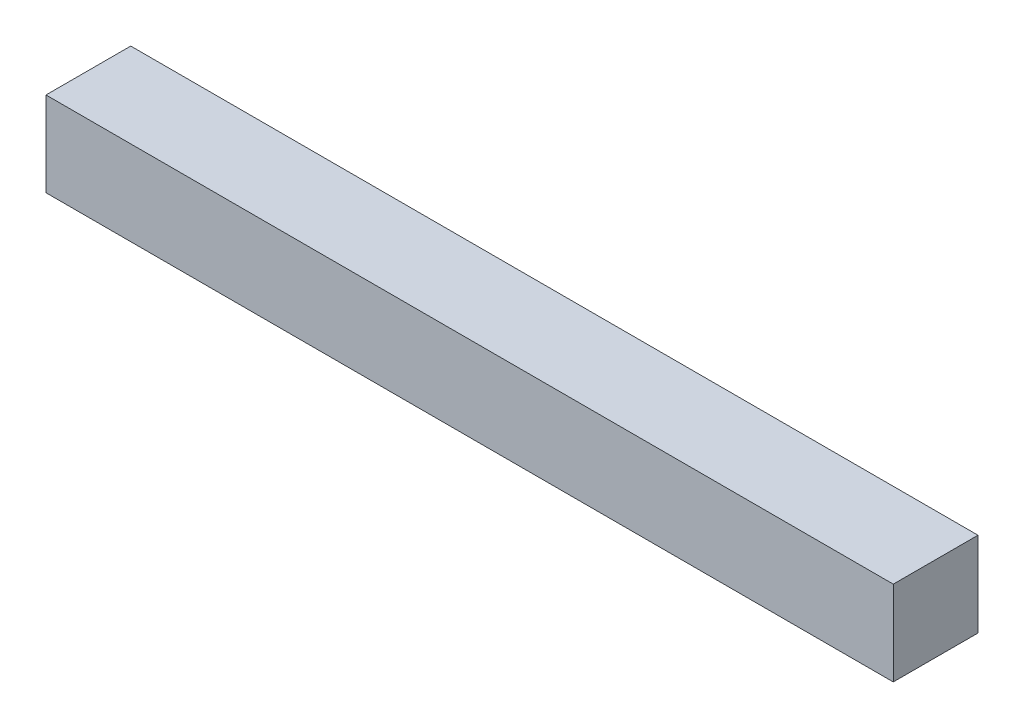
ISO-10303-21;
HEADER;
FILE_DESCRIPTION(('STEP AP214'),'2;1');
FILE_NAME('part.step','',(''),(''),'','','');
FILE_SCHEMA(('AUTOMOTIVE_DESIGN { 1 0 10303 214 1 1 1 1 }'));
ENDSEC;
DATA;
#1=APPLICATION_CONTEXT('core data for automotive mechanical design processes');
#2=APPLICATION_PROTOCOL_DEFINITION('international standard','automotive_design',2000,#1);
#3=PRODUCT_CONTEXT('',#1,'mechanical');
#4=PRODUCT('Part','Part','',(#3));
#5=PRODUCT_RELATED_PRODUCT_CATEGORY('part','',(#4));
#6=PRODUCT_DEFINITION_FORMATION('','',#4);
#7=PRODUCT_DEFINITION_CONTEXT('part definition',#1,'design');
#8=PRODUCT_DEFINITION('design','',#6,#7);
#9=PRODUCT_DEFINITION_SHAPE('','',#8);
#10=(LENGTH_UNIT() NAMED_UNIT(*) SI_UNIT(.MILLI.,.METRE.));
#11=(NAMED_UNIT(*) PLANE_ANGLE_UNIT() SI_UNIT($,.RADIAN.));
#12=(NAMED_UNIT(*) SI_UNIT($,.STERADIAN.) SOLID_ANGLE_UNIT());
#13=UNCERTAINTY_MEASURE_WITH_UNIT(LENGTH_MEASURE(1.E-05),#10,'distance_accuracy_value','');
#14=(GEOMETRIC_REPRESENTATION_CONTEXT(3) GLOBAL_UNCERTAINTY_ASSIGNED_CONTEXT((#13)) GLOBAL_UNIT_ASSIGNED_CONTEXT((#10,
#11,#12)) REPRESENTATION_CONTEXT('',''));
#15=CARTESIAN_POINT('',(0.,0.,0.));
#16=DIRECTION('',(0.,0.,1.));
#17=DIRECTION('',(1.,0.,0.));
#18=AXIS2_PLACEMENT_3D('',#15,#16,#17);
#19=CARTESIAN_POINT('',(-68.6267419763514,15.3515625,30.));
#20=DIRECTION('',(1.,0.,0.));
#21=DIRECTION('',(0.,0.,-1.));
#22=AXIS2_PLACEMENT_3D('',#19,#20,#21);
#23=PLANE('',#22);
#24=DIRECTION('',(0.,-1.,0.));
#25=VECTOR('',#24,1.);
#26=CARTESIAN_POINT('',(-68.6267419763514,15.3515625,0.));
#27=LINE('',#26,#25);
#28=CARTESIAN_POINT('',(-68.6267419763514,15.3515625,0.));
#29=VERTEX_POINT('',#28);
#30=CARTESIAN_POINT('',(-68.6267419763514,-14.6484375,0.));
#31=VERTEX_POINT('',#30);
#32=EDGE_CURVE('E98',#29,#31,#27,.T.);
#33=ORIENTED_EDGE('',*,*,#32,.T.);
#34=DIRECTION('',(0.,0.,-1.));
#35=VECTOR('',#34,1.);
#36=CARTESIAN_POINT('',(-68.6267419763514,-14.6484375,30.));
#37=LINE('',#36,#35);
#38=CARTESIAN_POINT('',(-68.6267419763514,-14.6484375,30.));
#39=VERTEX_POINT('',#38);
#40=EDGE_CURVE('E11',#39,#31,#37,.T.);
#41=ORIENTED_EDGE('',*,*,#40,.F.);
#42=DIRECTION('',(0.,-1.,0.));
#43=VECTOR('',#42,1.);
#44=CARTESIAN_POINT('',(-68.6267419763514,15.3515625,30.));
#45=LINE('',#44,#43);
#46=CARTESIAN_POINT('',(-68.6267419763514,15.3515625,30.));
#47=VERTEX_POINT('',#46);
#48=EDGE_CURVE('E86',#47,#39,#45,.T.);
#49=ORIENTED_EDGE('',*,*,#48,.F.);
#50=DIRECTION('',(0.,0.,-1.));
#51=VECTOR('',#50,1.);
#52=CARTESIAN_POINT('',(-68.6267419763514,15.3515625,30.));
#53=LINE('',#52,#51);
#54=EDGE_CURVE('E94',#47,#29,#53,.T.);
#55=ORIENTED_EDGE('',*,*,#54,.T.);
#56=EDGE_LOOP('',(#33,#41,#49,#55));
#57=FACE_BOUND('',#56,.T.);
#58=ADVANCED_FACE('F35',(#57),#23,.F.);
#59=CARTESIAN_POINT('',(-68.6267419763514,-14.6484375,30.));
#60=DIRECTION('',(0.,1.,0.));
#61=DIRECTION('',(-1.,0.,0.));
#62=AXIS2_PLACEMENT_3D('',#59,#60,#61);
#63=PLANE('',#62);
#64=DIRECTION('',(1.,0.,0.));
#65=VECTOR('',#64,1.);
#66=CARTESIAN_POINT('',(-68.6267419763514,-14.6484375,0.));
#67=LINE('',#66,#65);
#68=CARTESIAN_POINT('',(231.373258023649,-14.6484375,0.));
#69=VERTEX_POINT('',#68);
#70=EDGE_CURVE('E90',#31,#69,#67,.T.);
#71=ORIENTED_EDGE('',*,*,#70,.T.);
#72=DIRECTION('',(0.,0.,-1.));
#73=VECTOR('',#72,1.);
#74=CARTESIAN_POINT('',(231.373258023649,-14.6484375,30.));
#75=LINE('',#74,#73);
#76=CARTESIAN_POINT('',(231.373258023649,-14.6484375,30.));
#77=VERTEX_POINT('',#76);
#78=EDGE_CURVE('E43',#77,#69,#75,.T.);
#79=ORIENTED_EDGE('',*,*,#78,.F.);
#80=DIRECTION('',(1.,0.,0.));
#81=VECTOR('',#80,1.);
#82=CARTESIAN_POINT('',(-68.6267419763514,-14.6484375,30.));
#83=LINE('',#82,#81);
#84=EDGE_CURVE('E81',#39,#77,#83,.T.);
#85=ORIENTED_EDGE('',*,*,#84,.F.);
#86=ORIENTED_EDGE('',*,*,#40,.T.);
#87=EDGE_LOOP('',(#71,#79,#85,#86));
#88=FACE_BOUND('',#87,.T.);
#89=ADVANCED_FACE('F89',(#88),#63,.F.);
#90=CARTESIAN_POINT('',(231.373258023649,15.3515625,30.));
#91=DIRECTION('',(-1.,0.,0.));
#92=DIRECTION('',(0.,0.,1.));
#93=AXIS2_PLACEMENT_3D('',#90,#91,#92);
#94=PLANE('',#93);
#95=DIRECTION('',(0.,1.,0.));
#96=VECTOR('',#95,1.);
#97=CARTESIAN_POINT('',(231.373258023649,15.3515625,0.));
#98=LINE('',#97,#96);
#99=CARTESIAN_POINT('',(231.373258023649,15.3515625,0.));
#100=VERTEX_POINT('',#99);
#101=EDGE_CURVE('E68',#69,#100,#98,.T.);
#102=ORIENTED_EDGE('',*,*,#101,.T.);
#103=DIRECTION('',(0.,0.,-1.));
#104=VECTOR('',#103,1.);
#105=CARTESIAN_POINT('',(231.373258023649,15.3515625,30.));
#106=LINE('',#105,#104);
#107=CARTESIAN_POINT('',(231.373258023649,15.3515625,30.));
#108=VERTEX_POINT('',#107);
#109=EDGE_CURVE('E91',#108,#100,#106,.T.);
#110=ORIENTED_EDGE('',*,*,#109,.F.);
#111=DIRECTION('',(0.,1.,0.));
#112=VECTOR('',#111,1.);
#113=CARTESIAN_POINT('',(231.373258023649,15.3515625,30.));
#114=LINE('',#113,#112);
#115=EDGE_CURVE('E84',#77,#108,#114,.T.);
#116=ORIENTED_EDGE('',*,*,#115,.F.);
#117=ORIENTED_EDGE('',*,*,#78,.T.);
#118=EDGE_LOOP('',(#102,#110,#116,#117));
#119=FACE_BOUND('',#118,.T.);
#120=ADVANCED_FACE('F92',(#119),#94,.F.);
#121=CARTESIAN_POINT('',(-68.6267419763514,15.3515625,30.));
#122=DIRECTION('',(0.,-1.,0.));
#123=DIRECTION('',(0.,0.,-1.));
#124=AXIS2_PLACEMENT_3D('',#121,#122,#123);
#125=PLANE('',#124);
#126=DIRECTION('',(-1.,0.,0.));
#127=VECTOR('',#126,1.);
#128=CARTESIAN_POINT('',(-68.6267419763514,15.3515625,0.));
#129=LINE('',#128,#127);
#130=EDGE_CURVE('E74',#100,#29,#129,.T.);
#131=ORIENTED_EDGE('',*,*,#130,.T.);
#132=ORIENTED_EDGE('',*,*,#54,.F.);
#133=DIRECTION('',(-1.,0.,0.));
#134=VECTOR('',#133,1.);
#135=CARTESIAN_POINT('',(-68.6267419763514,15.3515625,30.));
#136=LINE('',#135,#134);
#137=EDGE_CURVE('E51',#108,#47,#136,.T.);
#138=ORIENTED_EDGE('',*,*,#137,.F.);
#139=ORIENTED_EDGE('',*,*,#109,.T.);
#140=EDGE_LOOP('',(#131,#132,#138,#139));
#141=FACE_BOUND('',#140,.T.);
#142=ADVANCED_FACE('F106',(#141),#125,.F.);
#143=CARTESIAN_POINT('',(0.,0.,30.));
#144=DIRECTION('',(0.,0.,1.));
#145=DIRECTION('',(1.,0.,0.));
#146=AXIS2_PLACEMENT_3D('',#143,#144,#145);
#147=PLANE('',#146);
#148=ORIENTED_EDGE('',*,*,#48,.T.);
#149=ORIENTED_EDGE('',*,*,#84,.T.);
#150=ORIENTED_EDGE('',*,*,#115,.T.);
#151=ORIENTED_EDGE('',*,*,#137,.T.);
#152=EDGE_LOOP('',(#148,#149,#150,#151));
#153=FACE_BOUND('',#152,.T.);
#154=ADVANCED_FACE('F82',(#153),#147,.T.);
#155=CARTESIAN_POINT('',(0.,0.,0.));
#156=DIRECTION('',(0.,0.,1.));
#157=DIRECTION('',(1.,0.,0.));
#158=AXIS2_PLACEMENT_3D('',#155,#156,#157);
#159=PLANE('',#158);
#160=CARTESIAN_POINT('',(-53.6267419763514,0.351562499999998,0.));
#161=DIRECTION('',(0.,0.,1.));
#162=DIRECTION('',(1.,0.,0.));
#163=AXIS2_PLACEMENT_3D('',#160,#161,#162);
#164=CIRCLE('',#163,5.99999999999999);
#165=CARTESIAN_POINT('',(-47.6267419763514,0.351562499999998,0.));
#166=VERTEX_POINT('',#165);
#167=EDGE_CURVE('E166',#166,#166,#164,.T.);
#168=ORIENTED_EDGE('',*,*,#167,.T.);
#169=EDGE_LOOP('',(#168));
#170=FACE_BOUND('',#169,.T.);
#171=CARTESIAN_POINT('',(-23.6267419763514,0.351562499999998,0.));
#172=DIRECTION('',(0.,0.,1.));
#173=DIRECTION('',(1.,0.,0.));
#174=AXIS2_PLACEMENT_3D('',#171,#172,#173);
#175=CIRCLE('',#174,6.);
#176=CARTESIAN_POINT('',(-17.6267419763514,0.351562499999998,0.));
#177=VERTEX_POINT('',#176);
#178=EDGE_CURVE('E160',#177,#177,#175,.T.);
#179=ORIENTED_EDGE('',*,*,#178,.T.);
#180=EDGE_LOOP('',(#179));
#181=FACE_BOUND('',#180,.T.);
#182=CARTESIAN_POINT('',(6.37325802364862,0.351562499999998,0.));
#183=DIRECTION('',(0.,0.,1.));
#184=DIRECTION('',(1.,0.,0.));
#185=AXIS2_PLACEMENT_3D('',#182,#183,#184);
#186=CIRCLE('',#185,6.);
#187=CARTESIAN_POINT('',(12.3732580236486,0.351562499999998,0.));
#188=VERTEX_POINT('',#187);
#189=EDGE_CURVE('E154',#188,#188,#186,.T.);
#190=ORIENTED_EDGE('',*,*,#189,.T.);
#191=EDGE_LOOP('',(#190));
#192=FACE_BOUND('',#191,.T.);
#193=CARTESIAN_POINT('',(36.3732580236486,0.351562499999998,0.));
#194=DIRECTION('',(0.,0.,1.));
#195=DIRECTION('',(1.,0.,0.));
#196=AXIS2_PLACEMENT_3D('',#193,#194,#195);
#197=CIRCLE('',#196,5.99999999999999);
#198=CARTESIAN_POINT('',(42.3732580236486,0.351562499999998,0.));
#199=VERTEX_POINT('',#198);
#200=EDGE_CURVE('E148',#199,#199,#197,.T.);
#201=ORIENTED_EDGE('',*,*,#200,.T.);
#202=EDGE_LOOP('',(#201));
#203=FACE_BOUND('',#202,.T.);
#204=CARTESIAN_POINT('',(66.3732580236486,0.351562499999998,0.));
#205=DIRECTION('',(0.,0.,1.));
#206=DIRECTION('',(1.,0.,0.));
#207=AXIS2_PLACEMENT_3D('',#204,#205,#206);
#208=CIRCLE('',#207,6.);
#209=CARTESIAN_POINT('',(72.3732580236486,0.351562499999998,0.));
#210=VERTEX_POINT('',#209);
#211=EDGE_CURVE('E142',#210,#210,#208,.T.);
#212=ORIENTED_EDGE('',*,*,#211,.T.);
#213=EDGE_LOOP('',(#212));
#214=FACE_BOUND('',#213,.T.);
#215=CARTESIAN_POINT('',(96.3732580236486,0.351562499999998,0.));
#216=DIRECTION('',(0.,0.,1.));
#217=DIRECTION('',(1.,0.,0.));
#218=AXIS2_PLACEMENT_3D('',#215,#216,#217);
#219=CIRCLE('',#218,6.);
#220=CARTESIAN_POINT('',(102.373258023649,0.351562499999998,0.));
#221=VERTEX_POINT('',#220);
#222=EDGE_CURVE('E136',#221,#221,#219,.T.);
#223=ORIENTED_EDGE('',*,*,#222,.T.);
#224=EDGE_LOOP('',(#223));
#225=FACE_BOUND('',#224,.T.);
#226=CARTESIAN_POINT('',(126.373258023649,0.351562499999998,0.));
#227=DIRECTION('',(0.,0.,1.));
#228=DIRECTION('',(1.,0.,0.));
#229=AXIS2_PLACEMENT_3D('',#226,#227,#228);
#230=CIRCLE('',#229,6.00000000000002);
#231=CARTESIAN_POINT('',(132.373258023649,0.351562499999998,0.));
#232=VERTEX_POINT('',#231);
#233=EDGE_CURVE('E130',#232,#232,#230,.T.);
#234=ORIENTED_EDGE('',*,*,#233,.T.);
#235=EDGE_LOOP('',(#234));
#236=FACE_BOUND('',#235,.T.);
#237=CARTESIAN_POINT('',(156.373258023649,0.351562499999998,0.));
#238=DIRECTION('',(0.,0.,1.));
#239=DIRECTION('',(1.,0.,0.));
#240=AXIS2_PLACEMENT_3D('',#237,#238,#239);
#241=CIRCLE('',#240,6.00000000000002);
#242=CARTESIAN_POINT('',(162.373258023649,0.351562499999998,0.));
#243=VERTEX_POINT('',#242);
#244=EDGE_CURVE('E124',#243,#243,#241,.T.);
#245=ORIENTED_EDGE('',*,*,#244,.T.);
#246=EDGE_LOOP('',(#245));
#247=FACE_BOUND('',#246,.T.);
#248=CARTESIAN_POINT('',(186.373258023649,0.351562499999998,0.));
#249=DIRECTION('',(0.,0.,1.));
#250=DIRECTION('',(1.,0.,0.));
#251=AXIS2_PLACEMENT_3D('',#248,#249,#250);
#252=CIRCLE('',#251,6.00000000000002);
#253=CARTESIAN_POINT('',(192.373258023649,0.351562499999998,0.));
#254=VERTEX_POINT('',#253);
#255=EDGE_CURVE('E118',#254,#254,#252,.T.);
#256=ORIENTED_EDGE('',*,*,#255,.T.);
#257=EDGE_LOOP('',(#256));
#258=FACE_BOUND('',#257,.T.);
#259=CARTESIAN_POINT('',(216.373258023649,0.351562499999998,0.));
#260=DIRECTION('',(0.,0.,1.));
#261=DIRECTION('',(1.,0.,0.));
#262=AXIS2_PLACEMENT_3D('',#259,#260,#261);
#263=CIRCLE('',#262,6.00000000000002);
#264=CARTESIAN_POINT('',(222.373258023649,0.351562499999998,0.));
#265=VERTEX_POINT('',#264);
#266=EDGE_CURVE('E112',#265,#265,#263,.T.);
#267=ORIENTED_EDGE('',*,*,#266,.T.);
#268=EDGE_LOOP('',(#267));
#269=FACE_BOUND('',#268,.T.);
#270=ORIENTED_EDGE('',*,*,#32,.F.);
#271=ORIENTED_EDGE('',*,*,#130,.F.);
#272=ORIENTED_EDGE('',*,*,#101,.F.);
#273=ORIENTED_EDGE('',*,*,#70,.F.);
#274=EDGE_LOOP('',(#270,#271,#272,#273));
#275=FACE_BOUND('',#274,.T.);
#276=ADVANCED_FACE('F109',(#170,#181,#192,#203,#214,#225,#236,#247,#258,#269,#275),#159,.F.);
#277=CARTESIAN_POINT('',(216.373258023649,0.351562499999998,10.));
#278=DIRECTION('',(0.,0.,-1.));
#279=DIRECTION('',(-1.,0.,0.));
#280=AXIS2_PLACEMENT_3D('',#277,#278,#279);
#281=CYLINDRICAL_SURFACE('',#280,6.00000000000002);
#282=CARTESIAN_POINT('',(216.373258023649,0.351562499999998,10.));
#283=DIRECTION('',(0.,0.,1.));
#284=DIRECTION('',(1.,0.,0.));
#285=AXIS2_PLACEMENT_3D('',#282,#283,#284);
#286=CIRCLE('',#285,6.00000000000002);
#287=CARTESIAN_POINT('',(222.373258023649,0.351562499999998,10.));
#288=VERTEX_POINT('',#287);
#289=EDGE_CURVE('E115',#288,#288,#286,.T.);
#290=ORIENTED_EDGE('',*,*,#289,.T.);
#291=EDGE_LOOP('',(#290));
#292=FACE_BOUND('',#291,.T.);
#293=ORIENTED_EDGE('',*,*,#266,.F.);
#294=EDGE_LOOP('',(#293));
#295=FACE_BOUND('',#294,.T.);
#296=ADVANCED_FACE('F196',(#292,#295),#281,.F.);
#297=CARTESIAN_POINT('',(216.373258023649,0.351562499999998,10.));
#298=DIRECTION('',(0.,0.,1.));
#299=DIRECTION('',(1.,0.,0.));
#300=AXIS2_PLACEMENT_3D('',#297,#298,#299);
#301=PLANE('',#300);
#302=ORIENTED_EDGE('',*,*,#289,.F.);
#303=EDGE_LOOP('',(#302));
#304=FACE_BOUND('',#303,.T.);
#305=ADVANCED_FACE('F202',(#304),#301,.F.);
#306=CARTESIAN_POINT('',(186.373258023649,0.351562499999998,10.));
#307=DIRECTION('',(0.,0.,-1.));
#308=DIRECTION('',(-1.,0.,0.));
#309=AXIS2_PLACEMENT_3D('',#306,#307,#308);
#310=CYLINDRICAL_SURFACE('',#309,6.00000000000002);
#311=CARTESIAN_POINT('',(186.373258023649,0.351562499999998,10.));
#312=DIRECTION('',(0.,0.,1.));
#313=DIRECTION('',(1.,0.,0.));
#314=AXIS2_PLACEMENT_3D('',#311,#312,#313);
#315=CIRCLE('',#314,6.00000000000002);
#316=CARTESIAN_POINT('',(192.373258023649,0.351562499999998,10.));
#317=VERTEX_POINT('',#316);
#318=EDGE_CURVE('E121',#317,#317,#315,.T.);
#319=ORIENTED_EDGE('',*,*,#318,.T.);
#320=EDGE_LOOP('',(#319));
#321=FACE_BOUND('',#320,.T.);
#322=ORIENTED_EDGE('',*,*,#255,.F.);
#323=EDGE_LOOP('',(#322));
#324=FACE_BOUND('',#323,.T.);
#325=ADVANCED_FACE('F206',(#321,#324),#310,.F.);
#326=CARTESIAN_POINT('',(186.373258023649,0.351562499999998,10.));
#327=DIRECTION('',(0.,0.,1.));
#328=DIRECTION('',(1.,0.,0.));
#329=AXIS2_PLACEMENT_3D('',#326,#327,#328);
#330=PLANE('',#329);
#331=ORIENTED_EDGE('',*,*,#318,.F.);
#332=EDGE_LOOP('',(#331));
#333=FACE_BOUND('',#332,.T.);
#334=ADVANCED_FACE('F210',(#333),#330,.F.);
#335=CARTESIAN_POINT('',(156.373258023649,0.351562499999998,10.));
#336=DIRECTION('',(0.,0.,-1.));
#337=DIRECTION('',(-1.,0.,0.));
#338=AXIS2_PLACEMENT_3D('',#335,#336,#337);
#339=CYLINDRICAL_SURFACE('',#338,6.00000000000002);
#340=CARTESIAN_POINT('',(156.373258023649,0.351562499999998,10.));
#341=DIRECTION('',(0.,0.,1.));
#342=DIRECTION('',(1.,0.,0.));
#343=AXIS2_PLACEMENT_3D('',#340,#341,#342);
#344=CIRCLE('',#343,6.00000000000002);
#345=CARTESIAN_POINT('',(162.373258023649,0.351562499999998,10.));
#346=VERTEX_POINT('',#345);
#347=EDGE_CURVE('E127',#346,#346,#344,.T.);
#348=ORIENTED_EDGE('',*,*,#347,.T.);
#349=EDGE_LOOP('',(#348));
#350=FACE_BOUND('',#349,.T.);
#351=ORIENTED_EDGE('',*,*,#244,.F.);
#352=EDGE_LOOP('',(#351));
#353=FACE_BOUND('',#352,.T.);
#354=ADVANCED_FACE('F214',(#350,#353),#339,.F.);
#355=CARTESIAN_POINT('',(156.373258023649,0.351562499999998,10.));
#356=DIRECTION('',(0.,0.,1.));
#357=DIRECTION('',(1.,0.,0.));
#358=AXIS2_PLACEMENT_3D('',#355,#356,#357);
#359=PLANE('',#358);
#360=ORIENTED_EDGE('',*,*,#347,.F.);
#361=EDGE_LOOP('',(#360));
#362=FACE_BOUND('',#361,.T.);
#363=ADVANCED_FACE('F218',(#362),#359,.F.);
#364=CARTESIAN_POINT('',(126.373258023649,0.351562499999998,10.));
#365=DIRECTION('',(0.,0.,-1.));
#366=DIRECTION('',(-1.,0.,0.));
#367=AXIS2_PLACEMENT_3D('',#364,#365,#366);
#368=CYLINDRICAL_SURFACE('',#367,6.00000000000002);
#369=CARTESIAN_POINT('',(126.373258023649,0.351562499999998,10.));
#370=DIRECTION('',(0.,0.,1.));
#371=DIRECTION('',(1.,0.,0.));
#372=AXIS2_PLACEMENT_3D('',#369,#370,#371);
#373=CIRCLE('',#372,6.00000000000002);
#374=CARTESIAN_POINT('',(132.373258023649,0.351562499999998,10.));
#375=VERTEX_POINT('',#374);
#376=EDGE_CURVE('E133',#375,#375,#373,.T.);
#377=ORIENTED_EDGE('',*,*,#376,.T.);
#378=EDGE_LOOP('',(#377));
#379=FACE_BOUND('',#378,.T.);
#380=ORIENTED_EDGE('',*,*,#233,.F.);
#381=EDGE_LOOP('',(#380));
#382=FACE_BOUND('',#381,.T.);
#383=ADVANCED_FACE('F222',(#379,#382),#368,.F.);
#384=CARTESIAN_POINT('',(126.373258023649,0.351562499999998,10.));
#385=DIRECTION('',(0.,0.,1.));
#386=DIRECTION('',(1.,0.,0.));
#387=AXIS2_PLACEMENT_3D('',#384,#385,#386);
#388=PLANE('',#387);
#389=ORIENTED_EDGE('',*,*,#376,.F.);
#390=EDGE_LOOP('',(#389));
#391=FACE_BOUND('',#390,.T.);
#392=ADVANCED_FACE('F226',(#391),#388,.F.);
#393=CARTESIAN_POINT('',(96.3732580236486,0.351562499999998,10.));
#394=DIRECTION('',(0.,0.,-1.));
#395=DIRECTION('',(-1.,0.,0.));
#396=AXIS2_PLACEMENT_3D('',#393,#394,#395);
#397=CYLINDRICAL_SURFACE('',#396,6.);
#398=CARTESIAN_POINT('',(96.3732580236486,0.351562499999998,10.));
#399=DIRECTION('',(0.,0.,1.));
#400=DIRECTION('',(1.,0.,0.));
#401=AXIS2_PLACEMENT_3D('',#398,#399,#400);
#402=CIRCLE('',#401,6.);
#403=CARTESIAN_POINT('',(102.373258023649,0.351562499999998,10.));
#404=VERTEX_POINT('',#403);
#405=EDGE_CURVE('E139',#404,#404,#402,.T.);
#406=ORIENTED_EDGE('',*,*,#405,.T.);
#407=EDGE_LOOP('',(#406));
#408=FACE_BOUND('',#407,.T.);
#409=ORIENTED_EDGE('',*,*,#222,.F.);
#410=EDGE_LOOP('',(#409));
#411=FACE_BOUND('',#410,.T.);
#412=ADVANCED_FACE('F230',(#408,#411),#397,.F.);
#413=CARTESIAN_POINT('',(96.3732580236486,0.351562499999998,10.));
#414=DIRECTION('',(0.,0.,1.));
#415=DIRECTION('',(1.,0.,0.));
#416=AXIS2_PLACEMENT_3D('',#413,#414,#415);
#417=PLANE('',#416);
#418=ORIENTED_EDGE('',*,*,#405,.F.);
#419=EDGE_LOOP('',(#418));
#420=FACE_BOUND('',#419,.T.);
#421=ADVANCED_FACE('F234',(#420),#417,.F.);
#422=CARTESIAN_POINT('',(66.3732580236486,0.351562499999998,10.));
#423=DIRECTION('',(0.,0.,-1.));
#424=DIRECTION('',(-1.,0.,0.));
#425=AXIS2_PLACEMENT_3D('',#422,#423,#424);
#426=CYLINDRICAL_SURFACE('',#425,6.);
#427=CARTESIAN_POINT('',(66.3732580236486,0.351562499999998,10.));
#428=DIRECTION('',(0.,0.,1.));
#429=DIRECTION('',(1.,0.,0.));
#430=AXIS2_PLACEMENT_3D('',#427,#428,#429);
#431=CIRCLE('',#430,6.);
#432=CARTESIAN_POINT('',(72.3732580236486,0.351562499999998,10.));
#433=VERTEX_POINT('',#432);
#434=EDGE_CURVE('E145',#433,#433,#431,.T.);
#435=ORIENTED_EDGE('',*,*,#434,.T.);
#436=EDGE_LOOP('',(#435));
#437=FACE_BOUND('',#436,.T.);
#438=ORIENTED_EDGE('',*,*,#211,.F.);
#439=EDGE_LOOP('',(#438));
#440=FACE_BOUND('',#439,.T.);
#441=ADVANCED_FACE('F238',(#437,#440),#426,.F.);
#442=CARTESIAN_POINT('',(66.3732580236486,0.351562499999998,10.));
#443=DIRECTION('',(0.,0.,1.));
#444=DIRECTION('',(1.,0.,0.));
#445=AXIS2_PLACEMENT_3D('',#442,#443,#444);
#446=PLANE('',#445);
#447=ORIENTED_EDGE('',*,*,#434,.F.);
#448=EDGE_LOOP('',(#447));
#449=FACE_BOUND('',#448,.T.);
#450=ADVANCED_FACE('F242',(#449),#446,.F.);
#451=CARTESIAN_POINT('',(36.3732580236486,0.351562499999998,10.));
#452=DIRECTION('',(0.,0.,-1.));
#453=DIRECTION('',(-1.,0.,0.));
#454=AXIS2_PLACEMENT_3D('',#451,#452,#453);
#455=CYLINDRICAL_SURFACE('',#454,5.99999999999999);
#456=CARTESIAN_POINT('',(36.3732580236486,0.351562499999998,10.));
#457=DIRECTION('',(0.,0.,1.));
#458=DIRECTION('',(1.,0.,0.));
#459=AXIS2_PLACEMENT_3D('',#456,#457,#458);
#460=CIRCLE('',#459,5.99999999999999);
#461=CARTESIAN_POINT('',(42.3732580236486,0.351562499999998,10.));
#462=VERTEX_POINT('',#461);
#463=EDGE_CURVE('E151',#462,#462,#460,.T.);
#464=ORIENTED_EDGE('',*,*,#463,.T.);
#465=EDGE_LOOP('',(#464));
#466=FACE_BOUND('',#465,.T.);
#467=ORIENTED_EDGE('',*,*,#200,.F.);
#468=EDGE_LOOP('',(#467));
#469=FACE_BOUND('',#468,.T.);
#470=ADVANCED_FACE('F246',(#466,#469),#455,.F.);
#471=CARTESIAN_POINT('',(36.3732580236486,0.351562499999998,10.));
#472=DIRECTION('',(0.,0.,1.));
#473=DIRECTION('',(1.,0.,0.));
#474=AXIS2_PLACEMENT_3D('',#471,#472,#473);
#475=PLANE('',#474);
#476=ORIENTED_EDGE('',*,*,#463,.F.);
#477=EDGE_LOOP('',(#476));
#478=FACE_BOUND('',#477,.T.);
#479=ADVANCED_FACE('F250',(#478),#475,.F.);
#480=CARTESIAN_POINT('',(6.37325802364862,0.351562499999998,10.));
#481=DIRECTION('',(0.,0.,-1.));
#482=DIRECTION('',(-1.,0.,0.));
#483=AXIS2_PLACEMENT_3D('',#480,#481,#482);
#484=CYLINDRICAL_SURFACE('',#483,6.);
#485=CARTESIAN_POINT('',(6.37325802364862,0.351562499999998,10.));
#486=DIRECTION('',(0.,0.,1.));
#487=DIRECTION('',(1.,0.,0.));
#488=AXIS2_PLACEMENT_3D('',#485,#486,#487);
#489=CIRCLE('',#488,6.);
#490=CARTESIAN_POINT('',(12.3732580236486,0.351562499999998,10.));
#491=VERTEX_POINT('',#490);
#492=EDGE_CURVE('E157',#491,#491,#489,.T.);
#493=ORIENTED_EDGE('',*,*,#492,.T.);
#494=EDGE_LOOP('',(#493));
#495=FACE_BOUND('',#494,.T.);
#496=ORIENTED_EDGE('',*,*,#189,.F.);
#497=EDGE_LOOP('',(#496));
#498=FACE_BOUND('',#497,.T.);
#499=ADVANCED_FACE('F254',(#495,#498),#484,.F.);
#500=CARTESIAN_POINT('',(6.37325802364862,0.351562499999998,10.));
#501=DIRECTION('',(0.,0.,1.));
#502=DIRECTION('',(1.,0.,0.));
#503=AXIS2_PLACEMENT_3D('',#500,#501,#502);
#504=PLANE('',#503);
#505=ORIENTED_EDGE('',*,*,#492,.F.);
#506=EDGE_LOOP('',(#505));
#507=FACE_BOUND('',#506,.T.);
#508=ADVANCED_FACE('F258',(#507),#504,.F.);
#509=CARTESIAN_POINT('',(-23.6267419763514,0.351562499999998,10.));
#510=DIRECTION('',(0.,0.,-1.));
#511=DIRECTION('',(-1.,0.,0.));
#512=AXIS2_PLACEMENT_3D('',#509,#510,#511);
#513=CYLINDRICAL_SURFACE('',#512,6.);
#514=CARTESIAN_POINT('',(-23.6267419763514,0.351562499999998,10.));
#515=DIRECTION('',(0.,0.,1.));
#516=DIRECTION('',(1.,0.,0.));
#517=AXIS2_PLACEMENT_3D('',#514,#515,#516);
#518=CIRCLE('',#517,6.);
#519=CARTESIAN_POINT('',(-17.6267419763514,0.351562499999998,10.));
#520=VERTEX_POINT('',#519);
#521=EDGE_CURVE('E163',#520,#520,#518,.T.);
#522=ORIENTED_EDGE('',*,*,#521,.T.);
#523=EDGE_LOOP('',(#522));
#524=FACE_BOUND('',#523,.T.);
#525=ORIENTED_EDGE('',*,*,#178,.F.);
#526=EDGE_LOOP('',(#525));
#527=FACE_BOUND('',#526,.T.);
#528=ADVANCED_FACE('F262',(#524,#527),#513,.F.);
#529=CARTESIAN_POINT('',(-23.6267419763514,0.351562499999998,10.));
#530=DIRECTION('',(0.,0.,1.));
#531=DIRECTION('',(1.,0.,0.));
#532=AXIS2_PLACEMENT_3D('',#529,#530,#531);
#533=PLANE('',#532);
#534=ORIENTED_EDGE('',*,*,#521,.F.);
#535=EDGE_LOOP('',(#534));
#536=FACE_BOUND('',#535,.T.);
#537=ADVANCED_FACE('F181',(#536),#533,.F.);
#538=CARTESIAN_POINT('',(-53.6267419763514,0.351562499999998,10.));
#539=DIRECTION('',(0.,0.,-1.));
#540=DIRECTION('',(-1.,0.,0.));
#541=AXIS2_PLACEMENT_3D('',#538,#539,#540);
#542=CYLINDRICAL_SURFACE('',#541,5.99999999999999);
#543=CARTESIAN_POINT('',(-53.6267419763514,0.351562499999998,10.));
#544=DIRECTION('',(0.,0.,1.));
#545=DIRECTION('',(1.,0.,0.));
#546=AXIS2_PLACEMENT_3D('',#543,#544,#545);
#547=CIRCLE('',#546,5.99999999999999);
#548=CARTESIAN_POINT('',(-47.6267419763514,0.351562499999998,10.));
#549=VERTEX_POINT('',#548);
#550=EDGE_CURVE('E101',#549,#549,#547,.T.);
#551=ORIENTED_EDGE('',*,*,#550,.T.);
#552=EDGE_LOOP('',(#551));
#553=FACE_BOUND('',#552,.T.);
#554=ORIENTED_EDGE('',*,*,#167,.F.);
#555=EDGE_LOOP('',(#554));
#556=FACE_BOUND('',#555,.T.);
#557=ADVANCED_FACE('F172',(#553,#556),#542,.F.);
#558=CARTESIAN_POINT('',(-53.6267419763514,0.351562499999998,10.));
#559=DIRECTION('',(0.,0.,1.));
#560=DIRECTION('',(1.,0.,0.));
#561=AXIS2_PLACEMENT_3D('',#558,#559,#560);
#562=PLANE('',#561);
#563=ORIENTED_EDGE('',*,*,#550,.F.);
#564=EDGE_LOOP('',(#563));
#565=FACE_BOUND('',#564,.T.);
#566=ADVANCED_FACE('F175',(#565),#562,.F.);
#567=CLOSED_SHELL('',(#58,#89,#120,#142,#154,#276,#296,#305,#325,#334,#354,#363,#383,#392,#412,
#421,#441,#450,#470,#479,#499,#508,#528,#537,#557,#566));
#568=MANIFOLD_SOLID_BREP('B2',#567);
#569=ADVANCED_BREP_SHAPE_REPRESENTATION('',(#18,#568),#14);
#570=SHAPE_DEFINITION_REPRESENTATION(#9,#569);
ENDSEC;
END-ISO-10303-21;
